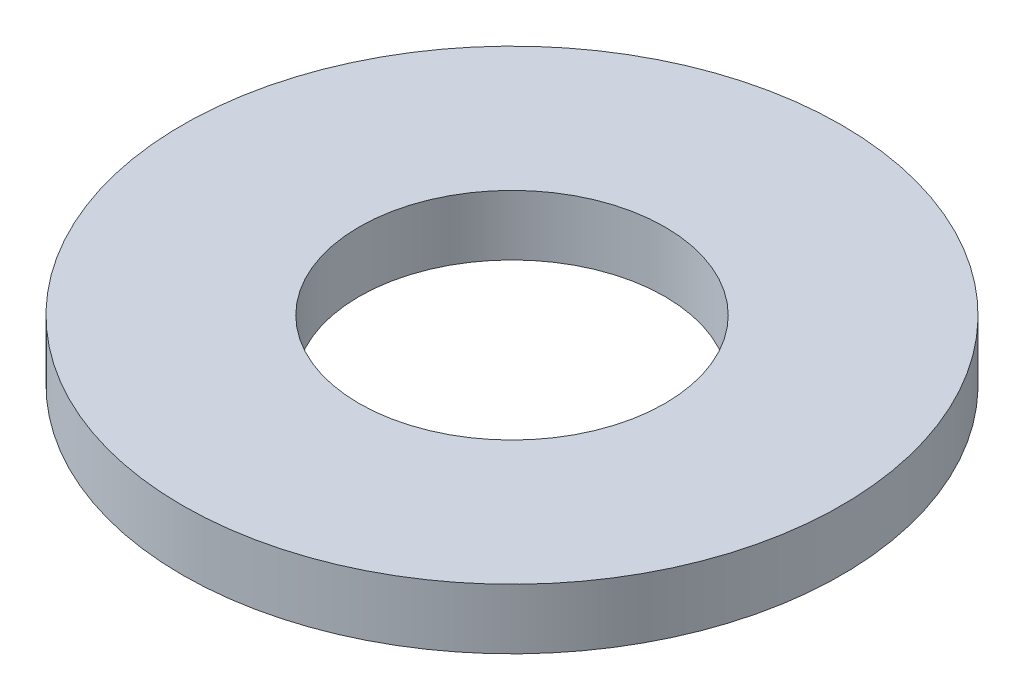
ISO-10303-21;
HEADER;
FILE_DESCRIPTION(('STEP AP214'),'2;1');
FILE_NAME('part.step','',(''),(''),'','','');
FILE_SCHEMA(('AUTOMOTIVE_DESIGN { 1 0 10303 214 1 1 1 1 }'));
ENDSEC;
DATA;
#1=APPLICATION_CONTEXT('core data for automotive mechanical design processes');
#2=APPLICATION_PROTOCOL_DEFINITION('international standard','automotive_design',2000,#1);
#3=PRODUCT_CONTEXT('',#1,'mechanical');
#4=PRODUCT('Part','Part','',(#3));
#5=PRODUCT_RELATED_PRODUCT_CATEGORY('part','',(#4));
#6=PRODUCT_DEFINITION_FORMATION('','',#4);
#7=PRODUCT_DEFINITION_CONTEXT('part definition',#1,'design');
#8=PRODUCT_DEFINITION('design','',#6,#7);
#9=PRODUCT_DEFINITION_SHAPE('','',#8);
#10=(LENGTH_UNIT() NAMED_UNIT(*) SI_UNIT(.MILLI.,.METRE.));
#11=(NAMED_UNIT(*) PLANE_ANGLE_UNIT() SI_UNIT($,.RADIAN.));
#12=(NAMED_UNIT(*) SI_UNIT($,.STERADIAN.) SOLID_ANGLE_UNIT());
#13=UNCERTAINTY_MEASURE_WITH_UNIT(LENGTH_MEASURE(1.E-05),#10,'distance_accuracy_value','');
#14=(GEOMETRIC_REPRESENTATION_CONTEXT(3) GLOBAL_UNCERTAINTY_ASSIGNED_CONTEXT((#13)) GLOBAL_UNIT_ASSIGNED_CONTEXT((#10,
#11,#12)) REPRESENTATION_CONTEXT('',''));
#15=CARTESIAN_POINT('',(0.,0.,0.));
#16=DIRECTION('',(0.,0.,1.));
#17=DIRECTION('',(1.,0.,0.));
#18=AXIS2_PLACEMENT_3D('',#15,#16,#17);
#19=CARTESIAN_POINT('',(0.,1.016,0.));
#20=DIRECTION('',(0.,-1.,0.));
#21=DIRECTION('',(0.,0.,-1.));
#22=AXIS2_PLACEMENT_3D('',#19,#20,#21);
#23=CYLINDRICAL_SURFACE('',#22,5.55625);
#24=CARTESIAN_POINT('',(0.,1.016,0.));
#25=DIRECTION('',(0.,1.,0.));
#26=DIRECTION('',(0.,0.,1.));
#27=AXIS2_PLACEMENT_3D('',#24,#25,#26);
#28=CIRCLE('',#27,5.55625);
#29=CARTESIAN_POINT('',(0.,1.016,5.55625));
#30=VERTEX_POINT('',#29);
#31=EDGE_CURVE('E10',#30,#30,#28,.T.);
#32=ORIENTED_EDGE('',*,*,#31,.F.);
#33=EDGE_LOOP('',(#32));
#34=FACE_BOUND('',#33,.T.);
#35=CARTESIAN_POINT('',(0.,0.,0.));
#36=DIRECTION('',(0.,1.,0.));
#37=DIRECTION('',(0.,0.,1.));
#38=AXIS2_PLACEMENT_3D('',#35,#36,#37);
#39=CIRCLE('',#38,5.55625);
#40=CARTESIAN_POINT('',(0.,0.,5.55625));
#41=VERTEX_POINT('',#40);
#42=EDGE_CURVE('E36',#41,#41,#39,.T.);
#43=ORIENTED_EDGE('',*,*,#42,.T.);
#44=EDGE_LOOP('',(#43));
#45=FACE_BOUND('',#44,.T.);
#46=ADVANCED_FACE('F33',(#34,#45),#23,.T.);
#47=CARTESIAN_POINT('',(0.,1.016,0.));
#48=DIRECTION('',(0.,1.,0.));
#49=DIRECTION('',(0.,0.,1.));
#50=AXIS2_PLACEMENT_3D('',#47,#48,#49);
#51=PLANE('',#50);
#52=CARTESIAN_POINT('',(0.,1.016,0.));
#53=DIRECTION('',(0.,1.,0.));
#54=DIRECTION('',(0.,0.,1.));
#55=AXIS2_PLACEMENT_3D('',#52,#53,#54);
#56=CIRCLE('',#55,2.5781);
#57=CARTESIAN_POINT('',(0.,1.016,2.5781));
#58=VERTEX_POINT('',#57);
#59=EDGE_CURVE('E45',#58,#58,#56,.T.);
#60=ORIENTED_EDGE('',*,*,#59,.F.);
#61=EDGE_LOOP('',(#60));
#62=FACE_BOUND('',#61,.T.);
#63=ORIENTED_EDGE('',*,*,#31,.T.);
#64=EDGE_LOOP('',(#63));
#65=FACE_BOUND('',#64,.T.);
#66=ADVANCED_FACE('F60',(#62,#65),#51,.T.);
#67=CARTESIAN_POINT('',(0.,0.,0.));
#68=DIRECTION('',(0.,1.,0.));
#69=DIRECTION('',(0.,0.,1.));
#70=AXIS2_PLACEMENT_3D('',#67,#68,#69);
#71=PLANE('',#70);
#72=CARTESIAN_POINT('',(0.,0.,0.));
#73=DIRECTION('',(0.,1.,0.));
#74=DIRECTION('',(0.,0.,1.));
#75=AXIS2_PLACEMENT_3D('',#72,#73,#74);
#76=CIRCLE('',#75,2.5781);
#77=CARTESIAN_POINT('',(0.,0.,2.5781));
#78=VERTEX_POINT('',#77);
#79=EDGE_CURVE('E43',#78,#78,#76,.T.);
#80=ORIENTED_EDGE('',*,*,#79,.T.);
#81=EDGE_LOOP('',(#80));
#82=FACE_BOUND('',#81,.T.);
#83=ORIENTED_EDGE('',*,*,#42,.F.);
#84=EDGE_LOOP('',(#83));
#85=FACE_BOUND('',#84,.T.);
#86=ADVANCED_FACE('F51',(#82,#85),#71,.F.);
#87=CARTESIAN_POINT('',(0.,0.,0.));
#88=DIRECTION('',(0.,1.,0.));
#89=DIRECTION('',(0.,0.,1.));
#90=AXIS2_PLACEMENT_3D('',#87,#88,#89);
#91=CYLINDRICAL_SURFACE('',#90,2.5781);
#92=ORIENTED_EDGE('',*,*,#79,.F.);
#93=EDGE_LOOP('',(#92));
#94=FACE_BOUND('',#93,.T.);
#95=ORIENTED_EDGE('',*,*,#59,.T.);
#96=EDGE_LOOP('',(#95));
#97=FACE_BOUND('',#96,.T.);
#98=ADVANCED_FACE('F54',(#94,#97),#91,.F.);
#99=CLOSED_SHELL('',(#46,#66,#86,#98));
#100=MANIFOLD_SOLID_BREP('B2',#99);
#101=ADVANCED_BREP_SHAPE_REPRESENTATION('',(#18,#100),#14);
#102=SHAPE_DEFINITION_REPRESENTATION(#9,#101);
ENDSEC;
END-ISO-10303-21;
